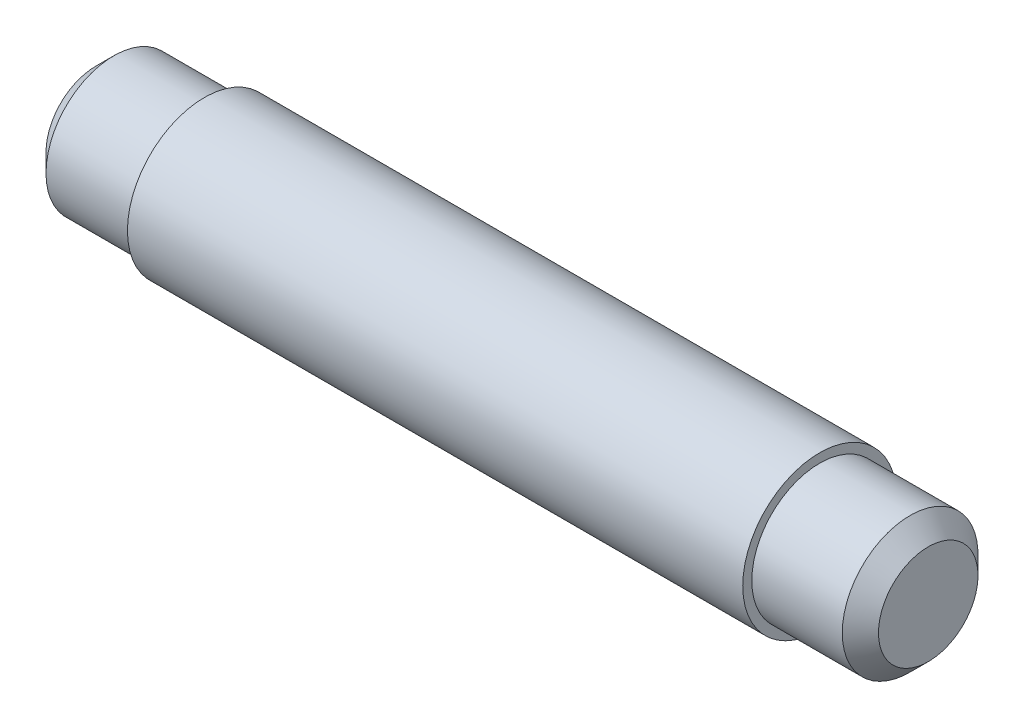
ISO-10303-21;
HEADER;
FILE_DESCRIPTION(('STEP AP214'),'2;1');
FILE_NAME('part.step','',(''),(''),'','','');
FILE_SCHEMA(('AUTOMOTIVE_DESIGN { 1 0 10303 214 1 1 1 1 }'));
ENDSEC;
DATA;
#1=APPLICATION_CONTEXT('core data for automotive mechanical design processes');
#2=APPLICATION_PROTOCOL_DEFINITION('international standard','automotive_design',2000,#1);
#3=PRODUCT_CONTEXT('',#1,'mechanical');
#4=PRODUCT('Part','Part','',(#3));
#5=PRODUCT_RELATED_PRODUCT_CATEGORY('part','',(#4));
#6=PRODUCT_DEFINITION_FORMATION('','',#4);
#7=PRODUCT_DEFINITION_CONTEXT('part definition',#1,'design');
#8=PRODUCT_DEFINITION('design','',#6,#7);
#9=PRODUCT_DEFINITION_SHAPE('','',#8);
#10=(LENGTH_UNIT() NAMED_UNIT(*) SI_UNIT(.MILLI.,.METRE.));
#11=(NAMED_UNIT(*) PLANE_ANGLE_UNIT() SI_UNIT($,.RADIAN.));
#12=(NAMED_UNIT(*) SI_UNIT($,.STERADIAN.) SOLID_ANGLE_UNIT());
#13=UNCERTAINTY_MEASURE_WITH_UNIT(LENGTH_MEASURE(1.E-05),#10,'distance_accuracy_value','');
#14=(GEOMETRIC_REPRESENTATION_CONTEXT(3) GLOBAL_UNCERTAINTY_ASSIGNED_CONTEXT((#13)) GLOBAL_UNIT_ASSIGNED_CONTEXT((#10,
#11,#12)) REPRESENTATION_CONTEXT('',''));
#15=CARTESIAN_POINT('',(0.,0.,0.));
#16=DIRECTION('',(0.,0.,1.));
#17=DIRECTION('',(1.,0.,0.));
#18=AXIS2_PLACEMENT_3D('',#15,#16,#17);
#19=CARTESIAN_POINT('',(0.,2.75,0.));
#20=DIRECTION('',(1.,0.,0.));
#21=DIRECTION('',(0.,0.,-1.));
#22=AXIS2_PLACEMENT_3D('',#19,#20,#21);
#23=PLANE('',#22);
#24=CARTESIAN_POINT('',(0.,0.,0.));
#25=DIRECTION('',(-1.,0.,0.));
#26=DIRECTION('',(0.,0.,1.));
#27=AXIS2_PLACEMENT_3D('',#24,#25,#26);
#28=CIRCLE('',#27,2.75);
#29=CARTESIAN_POINT('',(0.,0.,2.75));
#30=VERTEX_POINT('',#29);
#31=EDGE_CURVE('E72',#30,#30,#28,.T.);
#32=ORIENTED_EDGE('',*,*,#31,.T.);
#33=EDGE_LOOP('',(#32));
#34=FACE_BOUND('',#33,.T.);
#35=ADVANCED_FACE('F37',(#34),#23,.F.);
#36=CARTESIAN_POINT('',(46.,0.,0.));
#37=DIRECTION('',(-1.,0.,0.));
#38=DIRECTION('',(0.,0.,1.));
#39=AXIS2_PLACEMENT_3D('',#36,#37,#38);
#40=PLANE('',#39);
#41=CARTESIAN_POINT('',(46.,0.,0.));
#42=DIRECTION('',(-1.,0.,0.));
#43=DIRECTION('',(0.,0.,1.));
#44=AXIS2_PLACEMENT_3D('',#41,#42,#43);
#45=CIRCLE('',#44,2.75000000000001);
#46=CARTESIAN_POINT('',(46.,0.,2.75000000000001));
#47=VERTEX_POINT('',#46);
#48=EDGE_CURVE('E10',#47,#47,#45,.T.);
#49=ORIENTED_EDGE('',*,*,#48,.F.);
#50=EDGE_LOOP('',(#49));
#51=FACE_BOUND('',#50,.T.);
#52=ADVANCED_FACE('F115',(#51),#40,.F.);
#53=CARTESIAN_POINT('',(46.,0.,0.));
#54=DIRECTION('',(-1.,0.,0.));
#55=DIRECTION('',(0.,0.,1.));
#56=AXIS2_PLACEMENT_3D('',#53,#54,#55);
#57=CONICAL_SURFACE('',#56,2.75000000000001,0.785398163397448);
#58=CARTESIAN_POINT('',(45.,0.,0.));
#59=DIRECTION('',(-1.,0.,0.));
#60=DIRECTION('',(0.,0.,1.));
#61=AXIS2_PLACEMENT_3D('',#58,#59,#60);
#62=CIRCLE('',#61,3.75000000000001);
#63=CARTESIAN_POINT('',(45.,0.,3.75000000000001));
#64=VERTEX_POINT('',#63);
#65=EDGE_CURVE('E44',#64,#64,#62,.T.);
#66=ORIENTED_EDGE('',*,*,#65,.F.);
#67=EDGE_LOOP('',(#66));
#68=FACE_BOUND('',#67,.T.);
#69=ORIENTED_EDGE('',*,*,#48,.T.);
#70=EDGE_LOOP('',(#69));
#71=FACE_BOUND('',#70,.T.);
#72=ADVANCED_FACE('F110',(#68,#71),#57,.T.);
#73=CARTESIAN_POINT('',(0.,0.,0.));
#74=DIRECTION('',(-1.,0.,0.));
#75=DIRECTION('',(0.,0.,1.));
#76=AXIS2_PLACEMENT_3D('',#73,#74,#75);
#77=CYLINDRICAL_SURFACE('',#76,3.75000000000001);
#78=CARTESIAN_POINT('',(40.,0.,0.));
#79=DIRECTION('',(-1.,0.,0.));
#80=DIRECTION('',(0.,0.,1.));
#81=AXIS2_PLACEMENT_3D('',#78,#79,#80);
#82=CIRCLE('',#81,3.75000000000001);
#83=CARTESIAN_POINT('',(40.,0.,3.75000000000001));
#84=VERTEX_POINT('',#83);
#85=EDGE_CURVE('E49',#84,#84,#82,.T.);
#86=ORIENTED_EDGE('',*,*,#85,.F.);
#87=EDGE_LOOP('',(#86));
#88=FACE_BOUND('',#87,.T.);
#89=ORIENTED_EDGE('',*,*,#65,.T.);
#90=EDGE_LOOP('',(#89));
#91=FACE_BOUND('',#90,.T.);
#92=ADVANCED_FACE('F105',(#88,#91),#77,.T.);
#93=CARTESIAN_POINT('',(40.,3.75000000000001,0.));
#94=DIRECTION('',(-1.,0.,0.));
#95=DIRECTION('',(0.,0.,1.));
#96=AXIS2_PLACEMENT_3D('',#93,#94,#95);
#97=PLANE('',#96);
#98=CARTESIAN_POINT('',(40.,0.,0.));
#99=DIRECTION('',(-1.,0.,0.));
#100=DIRECTION('',(0.,0.,1.));
#101=AXIS2_PLACEMENT_3D('',#98,#99,#100);
#102=CIRCLE('',#101,4.25);
#103=CARTESIAN_POINT('',(40.,0.,4.25));
#104=VERTEX_POINT('',#103);
#105=EDGE_CURVE('E54',#104,#104,#102,.T.);
#106=ORIENTED_EDGE('',*,*,#105,.F.);
#107=EDGE_LOOP('',(#106));
#108=FACE_BOUND('',#107,.T.);
#109=ORIENTED_EDGE('',*,*,#85,.T.);
#110=EDGE_LOOP('',(#109));
#111=FACE_BOUND('',#110,.T.);
#112=ADVANCED_FACE('F99',(#108,#111),#97,.F.);
#113=CARTESIAN_POINT('',(0.,0.,0.));
#114=DIRECTION('',(-1.,0.,0.));
#115=DIRECTION('',(0.,0.,1.));
#116=AXIS2_PLACEMENT_3D('',#113,#114,#115);
#117=CYLINDRICAL_SURFACE('',#116,4.25);
#118=CARTESIAN_POINT('',(6.,0.,0.));
#119=DIRECTION('',(-1.,0.,0.));
#120=DIRECTION('',(0.,0.,1.));
#121=AXIS2_PLACEMENT_3D('',#118,#119,#120);
#122=CIRCLE('',#121,4.25);
#123=CARTESIAN_POINT('',(6.,0.,4.25));
#124=VERTEX_POINT('',#123);
#125=EDGE_CURVE('E60',#124,#124,#122,.T.);
#126=ORIENTED_EDGE('',*,*,#125,.F.);
#127=EDGE_LOOP('',(#126));
#128=FACE_BOUND('',#127,.T.);
#129=ORIENTED_EDGE('',*,*,#105,.T.);
#130=EDGE_LOOP('',(#129));
#131=FACE_BOUND('',#130,.T.);
#132=ADVANCED_FACE('F93',(#128,#131),#117,.T.);
#133=CARTESIAN_POINT('',(6.,4.25,0.));
#134=DIRECTION('',(1.,0.,0.));
#135=DIRECTION('',(0.,0.,-1.));
#136=AXIS2_PLACEMENT_3D('',#133,#134,#135);
#137=PLANE('',#136);
#138=CARTESIAN_POINT('',(6.,0.,0.));
#139=DIRECTION('',(-1.,0.,0.));
#140=DIRECTION('',(0.,0.,1.));
#141=AXIS2_PLACEMENT_3D('',#138,#139,#140);
#142=CIRCLE('',#141,3.75);
#143=CARTESIAN_POINT('',(6.,0.,3.75));
#144=VERTEX_POINT('',#143);
#145=EDGE_CURVE('E64',#144,#144,#142,.T.);
#146=ORIENTED_EDGE('',*,*,#145,.F.);
#147=EDGE_LOOP('',(#146));
#148=FACE_BOUND('',#147,.T.);
#149=ORIENTED_EDGE('',*,*,#125,.T.);
#150=EDGE_LOOP('',(#149));
#151=FACE_BOUND('',#150,.T.);
#152=ADVANCED_FACE('F87',(#148,#151),#137,.F.);
#153=CARTESIAN_POINT('',(0.,0.,0.));
#154=DIRECTION('',(-1.,0.,0.));
#155=DIRECTION('',(0.,0.,1.));
#156=AXIS2_PLACEMENT_3D('',#153,#154,#155);
#157=CYLINDRICAL_SURFACE('',#156,3.75);
#158=CARTESIAN_POINT('',(1.,0.,0.));
#159=DIRECTION('',(-1.,0.,0.));
#160=DIRECTION('',(0.,0.,1.));
#161=AXIS2_PLACEMENT_3D('',#158,#159,#160);
#162=CIRCLE('',#161,3.75);
#163=CARTESIAN_POINT('',(1.,0.,3.75));
#164=VERTEX_POINT('',#163);
#165=EDGE_CURVE('E68',#164,#164,#162,.T.);
#166=ORIENTED_EDGE('',*,*,#165,.F.);
#167=EDGE_LOOP('',(#166));
#168=FACE_BOUND('',#167,.T.);
#169=ORIENTED_EDGE('',*,*,#145,.T.);
#170=EDGE_LOOP('',(#169));
#171=FACE_BOUND('',#170,.T.);
#172=ADVANCED_FACE('F81',(#168,#171),#157,.T.);
#173=CARTESIAN_POINT('',(1.,0.,0.));
#174=DIRECTION('',(1.,0.,0.));
#175=DIRECTION('',(0.,0.,-1.));
#176=AXIS2_PLACEMENT_3D('',#173,#174,#175);
#177=CONICAL_SURFACE('',#176,3.75,0.785398163397448);
#178=ORIENTED_EDGE('',*,*,#31,.F.);
#179=EDGE_LOOP('',(#178));
#180=FACE_BOUND('',#179,.T.);
#181=ORIENTED_EDGE('',*,*,#165,.T.);
#182=EDGE_LOOP('',(#181));
#183=FACE_BOUND('',#182,.T.);
#184=ADVANCED_FACE('F78',(#180,#183),#177,.T.);
#185=CLOSED_SHELL('',(#35,#52,#72,#92,#112,#132,#152,#172,#184));
#186=MANIFOLD_SOLID_BREP('B2',#185);
#187=ADVANCED_BREP_SHAPE_REPRESENTATION('',(#18,#186),#14);
#188=SHAPE_DEFINITION_REPRESENTATION(#9,#187);
ENDSEC;
END-ISO-10303-21;
